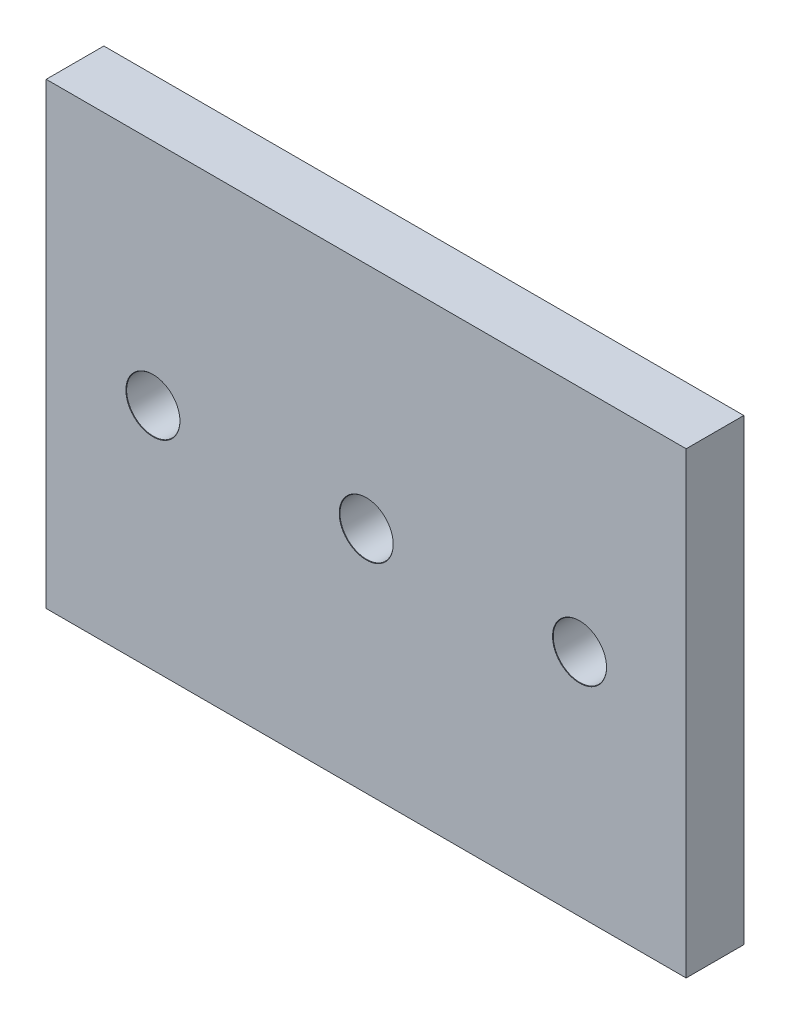
ISO-10303-21;
HEADER;
FILE_DESCRIPTION(('STEP AP214'),'2;1');
FILE_NAME('part.step','',(''),(''),'','','');
FILE_SCHEMA(('AUTOMOTIVE_DESIGN { 1 0 10303 214 1 1 1 1 }'));
ENDSEC;
DATA;
#1=APPLICATION_CONTEXT('core data for automotive mechanical design processes');
#2=APPLICATION_PROTOCOL_DEFINITION('international standard','automotive_design',2000,#1);
#3=PRODUCT_CONTEXT('',#1,'mechanical');
#4=PRODUCT('Part','Part','',(#3));
#5=PRODUCT_RELATED_PRODUCT_CATEGORY('part','',(#4));
#6=PRODUCT_DEFINITION_FORMATION('','',#4);
#7=PRODUCT_DEFINITION_CONTEXT('part definition',#1,'design');
#8=PRODUCT_DEFINITION('design','',#6,#7);
#9=PRODUCT_DEFINITION_SHAPE('','',#8);
#10=(LENGTH_UNIT() NAMED_UNIT(*) SI_UNIT(.MILLI.,.METRE.));
#11=(NAMED_UNIT(*) PLANE_ANGLE_UNIT() SI_UNIT($,.RADIAN.));
#12=(NAMED_UNIT(*) SI_UNIT($,.STERADIAN.) SOLID_ANGLE_UNIT());
#13=UNCERTAINTY_MEASURE_WITH_UNIT(LENGTH_MEASURE(1.E-05),#10,'distance_accuracy_value','');
#14=(GEOMETRIC_REPRESENTATION_CONTEXT(3) GLOBAL_UNCERTAINTY_ASSIGNED_CONTEXT((#13)) GLOBAL_UNIT_ASSIGNED_CONTEXT((#10,
#11,#12)) REPRESENTATION_CONTEXT('',''));
#15=CARTESIAN_POINT('',(0.,0.,0.));
#16=DIRECTION('',(0.,0.,1.));
#17=DIRECTION('',(1.,0.,0.));
#18=AXIS2_PLACEMENT_3D('',#15,#16,#17);
#19=CARTESIAN_POINT('',(-4.68599364637035,37.4134977131362,36.7100568001417));
#20=DIRECTION('',(1.,0.,0.));
#21=DIRECTION('',(0.,0.,-1.));
#22=AXIS2_PLACEMENT_3D('',#19,#20,#21);
#23=PLANE('',#22);
#24=DIRECTION('',(0.,-1.,0.));
#25=VECTOR('',#24,1.);
#26=CARTESIAN_POINT('',(-4.68599364637035,37.4134977131362,32.7100568001417));
#27=LINE('',#26,#25);
#28=CARTESIAN_POINT('',(-4.68599364637035,37.4134977131362,32.7100568001417));
#29=VERTEX_POINT('',#28);
#30=CARTESIAN_POINT('',(-4.68599364637035,5.61349771313621,32.7100568001417));
#31=VERTEX_POINT('',#30);
#32=EDGE_CURVE('E79',#29,#31,#27,.T.);
#33=ORIENTED_EDGE('',*,*,#32,.T.);
#34=DIRECTION('',(0.,0.,-1.));
#35=VECTOR('',#34,1.);
#36=CARTESIAN_POINT('',(-4.68599364637035,5.61349771313621,36.7100568001417));
#37=LINE('',#36,#35);
#38=CARTESIAN_POINT('',(-4.68599364637035,5.61349771313621,36.7100568001417));
#39=VERTEX_POINT('',#38);
#40=EDGE_CURVE('E10',#39,#31,#37,.T.);
#41=ORIENTED_EDGE('',*,*,#40,.F.);
#42=DIRECTION('',(0.,-1.,0.));
#43=VECTOR('',#42,1.);
#44=CARTESIAN_POINT('',(-4.68599364637035,37.4134977131362,36.7100568001417));
#45=LINE('',#44,#43);
#46=CARTESIAN_POINT('',(-4.68599364637035,37.4134977131362,36.7100568001417));
#47=VERTEX_POINT('',#46);
#48=EDGE_CURVE('E67',#47,#39,#45,.T.);
#49=ORIENTED_EDGE('',*,*,#48,.F.);
#50=DIRECTION('',(0.,0.,-1.));
#51=VECTOR('',#50,1.);
#52=CARTESIAN_POINT('',(-4.68599364637035,37.4134977131362,36.7100568001417));
#53=LINE('',#52,#51);
#54=EDGE_CURVE('E75',#47,#29,#53,.T.);
#55=ORIENTED_EDGE('',*,*,#54,.T.);
#56=EDGE_LOOP('',(#33,#41,#49,#55));
#57=FACE_BOUND('',#56,.T.);
#58=ADVANCED_FACE('F16',(#57),#23,.F.);
#59=CARTESIAN_POINT('',(-4.68599364637035,5.61349771313621,36.7100568001417));
#60=DIRECTION('',(0.,1.,0.));
#61=DIRECTION('',(0.,0.,1.));
#62=AXIS2_PLACEMENT_3D('',#59,#60,#61);
#63=PLANE('',#62);
#64=DIRECTION('',(1.,0.,0.));
#65=VECTOR('',#64,1.);
#66=CARTESIAN_POINT('',(-4.68599364637035,5.61349771313621,32.7100568001417));
#67=LINE('',#66,#65);
#68=CARTESIAN_POINT('',(39.7140063536296,5.61349771313621,32.7100568001417));
#69=VERTEX_POINT('',#68);
#70=EDGE_CURVE('E71',#31,#69,#67,.T.);
#71=ORIENTED_EDGE('',*,*,#70,.T.);
#72=DIRECTION('',(0.,0.,-1.));
#73=VECTOR('',#72,1.);
#74=CARTESIAN_POINT('',(39.7140063536296,5.61349771313621,36.7100568001417));
#75=LINE('',#74,#73);
#76=CARTESIAN_POINT('',(39.7140063536296,5.61349771313621,36.7100568001417));
#77=VERTEX_POINT('',#76);
#78=EDGE_CURVE('E24',#77,#69,#75,.T.);
#79=ORIENTED_EDGE('',*,*,#78,.F.);
#80=DIRECTION('',(1.,0.,0.));
#81=VECTOR('',#80,1.);
#82=CARTESIAN_POINT('',(-4.68599364637035,5.61349771313621,36.7100568001417));
#83=LINE('',#82,#81);
#84=EDGE_CURVE('E62',#39,#77,#83,.T.);
#85=ORIENTED_EDGE('',*,*,#84,.F.);
#86=ORIENTED_EDGE('',*,*,#40,.T.);
#87=EDGE_LOOP('',(#71,#79,#85,#86));
#88=FACE_BOUND('',#87,.T.);
#89=ADVANCED_FACE('F70',(#88),#63,.F.);
#90=CARTESIAN_POINT('',(39.7140063536296,37.4134977131362,36.7100568001417));
#91=DIRECTION('',(-1.,0.,0.));
#92=DIRECTION('',(0.,0.,1.));
#93=AXIS2_PLACEMENT_3D('',#90,#91,#92);
#94=PLANE('',#93);
#95=DIRECTION('',(0.,1.,0.));
#96=VECTOR('',#95,1.);
#97=CARTESIAN_POINT('',(39.7140063536296,37.4134977131362,32.7100568001417));
#98=LINE('',#97,#96);
#99=CARTESIAN_POINT('',(39.7140063536296,37.4134977131362,32.7100568001417));
#100=VERTEX_POINT('',#99);
#101=EDGE_CURVE('E49',#69,#100,#98,.T.);
#102=ORIENTED_EDGE('',*,*,#101,.T.);
#103=DIRECTION('',(0.,0.,-1.));
#104=VECTOR('',#103,1.);
#105=CARTESIAN_POINT('',(39.7140063536296,37.4134977131362,36.7100568001417));
#106=LINE('',#105,#104);
#107=CARTESIAN_POINT('',(39.7140063536296,37.4134977131362,36.7100568001417));
#108=VERTEX_POINT('',#107);
#109=EDGE_CURVE('E72',#108,#100,#106,.T.);
#110=ORIENTED_EDGE('',*,*,#109,.F.);
#111=DIRECTION('',(0.,1.,0.));
#112=VECTOR('',#111,1.);
#113=CARTESIAN_POINT('',(39.7140063536296,37.4134977131362,36.7100568001417));
#114=LINE('',#113,#112);
#115=EDGE_CURVE('E65',#77,#108,#114,.T.);
#116=ORIENTED_EDGE('',*,*,#115,.F.);
#117=ORIENTED_EDGE('',*,*,#78,.T.);
#118=EDGE_LOOP('',(#102,#110,#116,#117));
#119=FACE_BOUND('',#118,.T.);
#120=ADVANCED_FACE('F73',(#119),#94,.F.);
#121=CARTESIAN_POINT('',(-4.68599364637035,37.4134977131362,36.7100568001417));
#122=DIRECTION('',(0.,-1.,0.));
#123=DIRECTION('',(0.,0.,-1.));
#124=AXIS2_PLACEMENT_3D('',#121,#122,#123);
#125=PLANE('',#124);
#126=DIRECTION('',(-1.,0.,0.));
#127=VECTOR('',#126,1.);
#128=CARTESIAN_POINT('',(-4.68599364637035,37.4134977131362,32.7100568001417));
#129=LINE('',#128,#127);
#130=EDGE_CURVE('E55',#100,#29,#129,.T.);
#131=ORIENTED_EDGE('',*,*,#130,.T.);
#132=ORIENTED_EDGE('',*,*,#54,.F.);
#133=DIRECTION('',(-1.,0.,0.));
#134=VECTOR('',#133,1.);
#135=CARTESIAN_POINT('',(-4.68599364637035,37.4134977131362,36.7100568001417));
#136=LINE('',#135,#134);
#137=EDGE_CURVE('E32',#108,#47,#136,.T.);
#138=ORIENTED_EDGE('',*,*,#137,.F.);
#139=ORIENTED_EDGE('',*,*,#109,.T.);
#140=EDGE_LOOP('',(#131,#132,#138,#139));
#141=FACE_BOUND('',#140,.T.);
#142=ADVANCED_FACE('F87',(#141),#125,.F.);
#143=CARTESIAN_POINT('',(18.704388717633,19.3302907728985,36.7100568001417));
#144=DIRECTION('',(0.,0.,1.));
#145=DIRECTION('',(1.,0.,0.));
#146=AXIS2_PLACEMENT_3D('',#143,#144,#145);
#147=PLANE('',#146);
#148=CARTESIAN_POINT('',(2.71734497720567,21.5087439640782,36.7100568001417));
#149=DIRECTION('',(0.,0.,1.));
#150=DIRECTION('',(1.,0.,0.));
#151=AXIS2_PLACEMENT_3D('',#148,#149,#150);
#152=CIRCLE('',#151,1.875);
#153=CARTESIAN_POINT('',(4.59234497720567,21.5087439640782,36.7100568001417));
#154=VERTEX_POINT('',#153);
#155=EDGE_CURVE('E116',#154,#154,#152,.T.);
#156=ORIENTED_EDGE('',*,*,#155,.F.);
#157=EDGE_LOOP('',(#156));
#158=FACE_BOUND('',#157,.T.);
#159=CARTESIAN_POINT('',(17.5176841912257,21.5087439640782,36.7100568001417));
#160=DIRECTION('',(0.,0.,1.));
#161=DIRECTION('',(1.,0.,0.));
#162=AXIS2_PLACEMENT_3D('',#159,#160,#161);
#163=CIRCLE('',#162,1.875);
#164=CARTESIAN_POINT('',(19.3926841912257,21.5087439640782,36.7100568001417));
#165=VERTEX_POINT('',#164);
#166=EDGE_CURVE('E107',#165,#165,#163,.T.);
#167=ORIENTED_EDGE('',*,*,#166,.F.);
#168=EDGE_LOOP('',(#167));
#169=FACE_BOUND('',#168,.T.);
#170=CARTESIAN_POINT('',(32.3172607015212,21.5087439640782,36.7100568001417));
#171=DIRECTION('',(0.,0.,1.));
#172=DIRECTION('',(1.,0.,0.));
#173=AXIS2_PLACEMENT_3D('',#170,#171,#172);
#174=CIRCLE('',#173,1.875);
#175=CARTESIAN_POINT('',(34.1922607015212,21.5087439640782,36.7100568001417));
#176=VERTEX_POINT('',#175);
#177=EDGE_CURVE('E98',#176,#176,#174,.T.);
#178=ORIENTED_EDGE('',*,*,#177,.F.);
#179=EDGE_LOOP('',(#178));
#180=FACE_BOUND('',#179,.T.);
#181=ORIENTED_EDGE('',*,*,#48,.T.);
#182=ORIENTED_EDGE('',*,*,#84,.T.);
#183=ORIENTED_EDGE('',*,*,#115,.T.);
#184=ORIENTED_EDGE('',*,*,#137,.T.);
#185=EDGE_LOOP('',(#181,#182,#183,#184));
#186=FACE_BOUND('',#185,.T.);
#187=ADVANCED_FACE('F63',(#158,#169,#180,#186),#147,.T.);
#188=CARTESIAN_POINT('',(18.704388717633,19.3302907728985,32.7100568001417));
#189=DIRECTION('',(0.,0.,1.));
#190=DIRECTION('',(1.,0.,0.));
#191=AXIS2_PLACEMENT_3D('',#188,#189,#190);
#192=PLANE('',#191);
#193=CARTESIAN_POINT('',(2.71734497720567,21.5087439640782,32.7100568001417));
#194=DIRECTION('',(0.,0.,1.));
#195=DIRECTION('',(1.,0.,0.));
#196=AXIS2_PLACEMENT_3D('',#193,#194,#195);
#197=CIRCLE('',#196,1.85);
#198=CARTESIAN_POINT('',(4.56734497720567,21.5087439640782,32.7100568001417));
#199=VERTEX_POINT('',#198);
#200=EDGE_CURVE('E110',#199,#199,#197,.T.);
#201=ORIENTED_EDGE('',*,*,#200,.T.);
#202=EDGE_LOOP('',(#201));
#203=FACE_BOUND('',#202,.T.);
#204=CARTESIAN_POINT('',(17.5176841912257,21.5087439640782,32.7100568001417));
#205=DIRECTION('',(0.,0.,1.));
#206=DIRECTION('',(1.,0.,0.));
#207=AXIS2_PLACEMENT_3D('',#204,#205,#206);
#208=CIRCLE('',#207,1.85);
#209=CARTESIAN_POINT('',(19.3676841912257,21.5087439640782,32.7100568001417));
#210=VERTEX_POINT('',#209);
#211=EDGE_CURVE('E101',#210,#210,#208,.T.);
#212=ORIENTED_EDGE('',*,*,#211,.T.);
#213=EDGE_LOOP('',(#212));
#214=FACE_BOUND('',#213,.T.);
#215=CARTESIAN_POINT('',(32.3172607015212,21.5087439640782,32.7100568001417));
#216=DIRECTION('',(0.,0.,1.));
#217=DIRECTION('',(1.,0.,0.));
#218=AXIS2_PLACEMENT_3D('',#215,#216,#217);
#219=CIRCLE('',#218,1.85);
#220=CARTESIAN_POINT('',(34.1672607015212,21.5087439640782,32.7100568001417));
#221=VERTEX_POINT('',#220);
#222=EDGE_CURVE('E82',#221,#221,#219,.T.);
#223=ORIENTED_EDGE('',*,*,#222,.T.);
#224=EDGE_LOOP('',(#223));
#225=FACE_BOUND('',#224,.T.);
#226=ORIENTED_EDGE('',*,*,#32,.F.);
#227=ORIENTED_EDGE('',*,*,#130,.F.);
#228=ORIENTED_EDGE('',*,*,#101,.F.);
#229=ORIENTED_EDGE('',*,*,#70,.F.);
#230=EDGE_LOOP('',(#226,#227,#228,#229));
#231=FACE_BOUND('',#230,.T.);
#232=ADVANCED_FACE('F90',(#203,#214,#225,#231),#192,.F.);
#233=CARTESIAN_POINT('',(32.3172607015212,21.5087439640782,36.7100568001417));
#234=DIRECTION('',(0.,0.,1.));
#235=DIRECTION('',(1.,0.,0.));
#236=AXIS2_PLACEMENT_3D('',#233,#234,#235);
#237=CYLINDRICAL_SURFACE('',#236,1.85);
#238=ORIENTED_EDGE('',*,*,#222,.F.);
#239=EDGE_LOOP('',(#238));
#240=FACE_BOUND('',#239,.T.);
#241=CARTESIAN_POINT('',(32.3172607015212,21.5087439640782,36.6850568001418));
#242=DIRECTION('',(0.,0.,1.));
#243=DIRECTION('',(1.,0.,0.));
#244=AXIS2_PLACEMENT_3D('',#241,#242,#243);
#245=CIRCLE('',#244,1.85);
#246=CARTESIAN_POINT('',(34.1672607015212,21.5087439640782,36.6850568001418));
#247=VERTEX_POINT('',#246);
#248=EDGE_CURVE('E95',#247,#247,#245,.T.);
#249=ORIENTED_EDGE('',*,*,#248,.T.);
#250=EDGE_LOOP('',(#249));
#251=FACE_BOUND('',#250,.T.);
#252=ADVANCED_FACE('F132',(#240,#251),#237,.F.);
#253=CARTESIAN_POINT('',(32.3172607015212,21.5087439640782,36.7100568001417));
#254=DIRECTION('',(0.,0.,1.));
#255=DIRECTION('',(1.,0.,0.));
#256=AXIS2_PLACEMENT_3D('',#253,#254,#255);
#257=CONICAL_SURFACE('',#256,1.875,0.785398163397587);
#258=ORIENTED_EDGE('',*,*,#248,.F.);
#259=EDGE_LOOP('',(#258));
#260=FACE_BOUND('',#259,.T.);
#261=ORIENTED_EDGE('',*,*,#177,.T.);
#262=EDGE_LOOP('',(#261));
#263=FACE_BOUND('',#262,.T.);
#264=ADVANCED_FACE('F129',(#260,#263),#257,.F.);
#265=CARTESIAN_POINT('',(17.5176841912257,21.5087439640782,36.7100568001417));
#266=DIRECTION('',(0.,0.,1.));
#267=DIRECTION('',(1.,0.,0.));
#268=AXIS2_PLACEMENT_3D('',#265,#266,#267);
#269=CYLINDRICAL_SURFACE('',#268,1.85);
#270=ORIENTED_EDGE('',*,*,#211,.F.);
#271=EDGE_LOOP('',(#270));
#272=FACE_BOUND('',#271,.T.);
#273=CARTESIAN_POINT('',(17.5176841912257,21.5087439640782,36.6850568001418));
#274=DIRECTION('',(0.,0.,1.));
#275=DIRECTION('',(1.,0.,0.));
#276=AXIS2_PLACEMENT_3D('',#273,#274,#275);
#277=CIRCLE('',#276,1.85);
#278=CARTESIAN_POINT('',(19.3676841912257,21.5087439640782,36.6850568001418));
#279=VERTEX_POINT('',#278);
#280=EDGE_CURVE('E104',#279,#279,#277,.T.);
#281=ORIENTED_EDGE('',*,*,#280,.T.);
#282=EDGE_LOOP('',(#281));
#283=FACE_BOUND('',#282,.T.);
#284=ADVANCED_FACE('F131',(#272,#283),#269,.F.);
#285=CARTESIAN_POINT('',(17.5176841912257,21.5087439640782,36.7100568001417));
#286=DIRECTION('',(0.,0.,1.));
#287=DIRECTION('',(1.,0.,0.));
#288=AXIS2_PLACEMENT_3D('',#285,#286,#287);
#289=CONICAL_SURFACE('',#288,1.875,0.785398163397518);
#290=ORIENTED_EDGE('',*,*,#280,.F.);
#291=EDGE_LOOP('',(#290));
#292=FACE_BOUND('',#291,.T.);
#293=ORIENTED_EDGE('',*,*,#166,.T.);
#294=EDGE_LOOP('',(#293));
#295=FACE_BOUND('',#294,.T.);
#296=ADVANCED_FACE('F140',(#292,#295),#289,.F.);
#297=CARTESIAN_POINT('',(2.71734497720567,21.5087439640782,36.7100568001417));
#298=DIRECTION('',(0.,0.,1.));
#299=DIRECTION('',(1.,0.,0.));
#300=AXIS2_PLACEMENT_3D('',#297,#298,#299);
#301=CYLINDRICAL_SURFACE('',#300,1.85);
#302=ORIENTED_EDGE('',*,*,#200,.F.);
#303=EDGE_LOOP('',(#302));
#304=FACE_BOUND('',#303,.T.);
#305=CARTESIAN_POINT('',(2.71734497720567,21.5087439640782,36.6850568001418));
#306=DIRECTION('',(0.,0.,1.));
#307=DIRECTION('',(1.,0.,0.));
#308=AXIS2_PLACEMENT_3D('',#305,#306,#307);
#309=CIRCLE('',#308,1.85);
#310=CARTESIAN_POINT('',(4.56734497720567,21.5087439640782,36.6850568001418));
#311=VERTEX_POINT('',#310);
#312=EDGE_CURVE('E113',#311,#311,#309,.T.);
#313=ORIENTED_EDGE('',*,*,#312,.T.);
#314=EDGE_LOOP('',(#313));
#315=FACE_BOUND('',#314,.T.);
#316=ADVANCED_FACE('F172',(#304,#315),#301,.F.);
#317=CARTESIAN_POINT('',(2.71734497720567,21.5087439640782,36.7100568001417));
#318=DIRECTION('',(0.,0.,1.));
#319=DIRECTION('',(1.,0.,0.));
#320=AXIS2_PLACEMENT_3D('',#317,#318,#319);
#321=CONICAL_SURFACE('',#320,1.875,0.785398163397518);
#322=ORIENTED_EDGE('',*,*,#312,.F.);
#323=EDGE_LOOP('',(#322));
#324=FACE_BOUND('',#323,.T.);
#325=ORIENTED_EDGE('',*,*,#155,.T.);
#326=EDGE_LOOP('',(#325));
#327=FACE_BOUND('',#326,.T.);
#328=ADVANCED_FACE('F120',(#324,#327),#321,.F.);
#329=CLOSED_SHELL('',(#58,#89,#120,#142,#187,#232,#252,#264,#284,#296,#316,#328));
#330=MANIFOLD_SOLID_BREP('B1',#329);
#331=ADVANCED_BREP_SHAPE_REPRESENTATION('',(#18,#330),#14);
#332=SHAPE_DEFINITION_REPRESENTATION(#9,#331);
ENDSEC;
END-ISO-10303-21;
